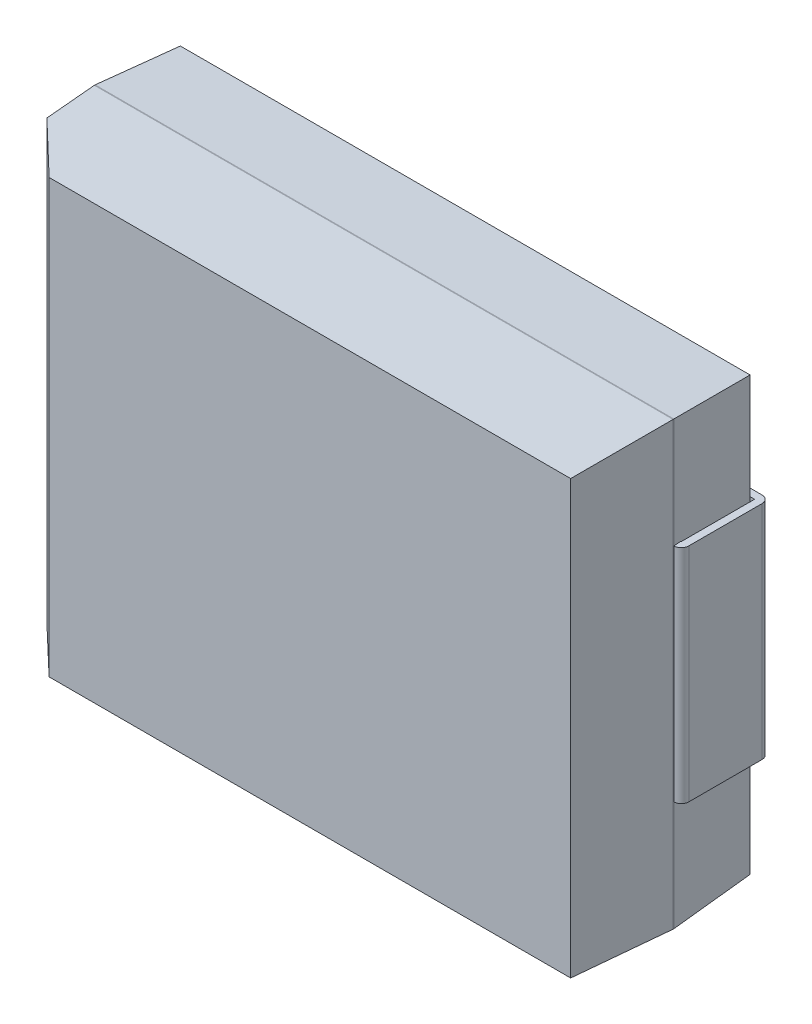
ISO-10303-21;
HEADER;
FILE_DESCRIPTION(('STEP AP214'),'2;1');
FILE_NAME('part.step','',(''),(''),'','','');
FILE_SCHEMA(('AUTOMOTIVE_DESIGN { 1 0 10303 214 1 1 1 1 }'));
ENDSEC;
DATA;
#1=APPLICATION_CONTEXT('core data for automotive mechanical design processes');
#2=APPLICATION_PROTOCOL_DEFINITION('international standard','automotive_design',2000,#1);
#3=PRODUCT_CONTEXT('',#1,'mechanical');
#4=PRODUCT('Part','Part','',(#3));
#5=PRODUCT_RELATED_PRODUCT_CATEGORY('part','',(#4));
#6=PRODUCT_DEFINITION_FORMATION('','',#4);
#7=PRODUCT_DEFINITION_CONTEXT('part definition',#1,'design');
#8=PRODUCT_DEFINITION('design','',#6,#7);
#9=PRODUCT_DEFINITION_SHAPE('','',#8);
#10=(LENGTH_UNIT() NAMED_UNIT(*) SI_UNIT(.MILLI.,.METRE.));
#11=(NAMED_UNIT(*) PLANE_ANGLE_UNIT() SI_UNIT($,.RADIAN.));
#12=(NAMED_UNIT(*) SI_UNIT($,.STERADIAN.) SOLID_ANGLE_UNIT());
#13=UNCERTAINTY_MEASURE_WITH_UNIT(LENGTH_MEASURE(1.E-05),#10,'distance_accuracy_value','');
#14=(GEOMETRIC_REPRESENTATION_CONTEXT(3) GLOBAL_UNCERTAINTY_ASSIGNED_CONTEXT((#13)) GLOBAL_UNIT_ASSIGNED_CONTEXT((#10,
#11,#12)) REPRESENTATION_CONTEXT('',''));
#15=CARTESIAN_POINT('',(0.,0.,0.));
#16=DIRECTION('',(0.,0.,1.));
#17=DIRECTION('',(1.,0.,0.));
#18=AXIS2_PLACEMENT_3D('',#15,#16,#17);
#19=CARTESIAN_POINT('',(-2.93,-1.4825,1.08));
#20=DIRECTION('',(1.,0.,0.));
#21=DIRECTION('',(0.,0.,-1.));
#22=AXIS2_PLACEMENT_3D('',#19,#20,#21);
#23=PLANE('',#22);
#24=DIRECTION('',(0.,0.,-1.));
#25=VECTOR('',#24,1.);
#26=CARTESIAN_POINT('',(-2.93,1.4825,1.08));
#27=LINE('',#26,#25);
#28=CARTESIAN_POINT('',(-2.93,1.4825,1.08));
#29=VERTEX_POINT('',#28);
#30=CARTESIAN_POINT('',(-2.93,1.4825,1.18));
#31=VERTEX_POINT('',#30);
#32=EDGE_CURVE('P0_E100',#29,#31,#27,.F.);
#33=ORIENTED_EDGE('',*,*,#32,.T.);
#34=DIRECTION('',(0.,1.,0.));
#35=VECTOR('',#34,1.);
#36=CARTESIAN_POINT('',(-2.93,-1.4825,1.18));
#37=LINE('',#36,#35);
#38=CARTESIAN_POINT('',(-2.93,-1.4825,1.18));
#39=VERTEX_POINT('',#38);
#40=EDGE_CURVE('P0_E95',#39,#31,#37,.T.);
#41=ORIENTED_EDGE('',*,*,#40,.F.);
#42=DIRECTION('',(0.,0.,-1.));
#43=VECTOR('',#42,1.);
#44=CARTESIAN_POINT('',(-2.93,-1.4825,1.08));
#45=LINE('',#44,#43);
#46=CARTESIAN_POINT('',(-2.93,-1.4825,1.08));
#47=VERTEX_POINT('',#46);
#48=EDGE_CURVE('P0_E134',#39,#47,#45,.T.);
#49=ORIENTED_EDGE('',*,*,#48,.T.);
#50=DIRECTION('',(0.,1.,0.));
#51=VECTOR('',#50,1.);
#52=CARTESIAN_POINT('',(-2.93,-1.4825,1.08));
#53=LINE('',#52,#51);
#54=EDGE_CURVE('P0_E110',#47,#29,#53,.T.);
#55=ORIENTED_EDGE('',*,*,#54,.T.);
#56=EDGE_LOOP('',(#33,#41,#49,#55));
#57=FACE_BOUND('',#56,.T.);
#58=ADVANCED_FACE('P0_F16',(#57),#23,.T.);
#59=CARTESIAN_POINT('',(-3.97,-1.4825,1.18));
#60=DIRECTION('',(0.,0.,1.));
#61=DIRECTION('',(1.,0.,0.));
#62=AXIS2_PLACEMENT_3D('',#59,#60,#61);
#63=PLANE('',#62);
#64=DIRECTION('',(1.,0.,0.));
#65=VECTOR('',#64,1.);
#66=CARTESIAN_POINT('',(-3.97,-1.4825,1.18));
#67=LINE('',#66,#65);
#68=CARTESIAN_POINT('',(-3.87,-1.4825,1.18));
#69=VERTEX_POINT('',#68);
#70=EDGE_CURVE('P0_E99',#69,#39,#67,.T.);
#71=ORIENTED_EDGE('',*,*,#70,.T.);
#72=ORIENTED_EDGE('',*,*,#40,.T.);
#73=DIRECTION('',(1.,0.,0.));
#74=VECTOR('',#73,1.);
#75=CARTESIAN_POINT('',(-3.97,1.4825,1.18));
#76=LINE('',#75,#74);
#77=CARTESIAN_POINT('',(-3.87,1.4825,1.18));
#78=VERTEX_POINT('',#77);
#79=EDGE_CURVE('P0_E90',#31,#78,#76,.F.);
#80=ORIENTED_EDGE('',*,*,#79,.T.);
#81=DIRECTION('',(0.,1.,0.));
#82=VECTOR('',#81,1.);
#83=CARTESIAN_POINT('',(-3.87,-1.4825,1.18));
#84=LINE('',#83,#82);
#85=EDGE_CURVE('P0_E93',#69,#78,#84,.T.);
#86=ORIENTED_EDGE('',*,*,#85,.F.);
#87=EDGE_LOOP('',(#71,#72,#80,#86));
#88=FACE_BOUND('',#87,.T.);
#89=ADVANCED_FACE('P0_F92',(#88),#63,.T.);
#90=CARTESIAN_POINT('',(-3.97,-1.4825,1.08));
#91=DIRECTION('',(0.,0.,1.));
#92=DIRECTION('',(1.,0.,0.));
#93=AXIS2_PLACEMENT_3D('',#90,#91,#92);
#94=PLANE('',#93);
#95=DIRECTION('',(1.,0.,0.));
#96=VECTOR('',#95,1.);
#97=CARTESIAN_POINT('',(-3.97,-1.4825,1.08));
#98=LINE('',#97,#96);
#99=CARTESIAN_POINT('',(-3.87,-1.4825,1.08));
#100=VERTEX_POINT('',#99);
#101=EDGE_CURVE('P0_E142',#100,#47,#98,.T.);
#102=ORIENTED_EDGE('',*,*,#101,.F.);
#103=DIRECTION('',(0.,1.,0.));
#104=VECTOR('',#103,1.);
#105=CARTESIAN_POINT('',(-3.87,-1.4825,1.08));
#106=LINE('',#105,#104);
#107=CARTESIAN_POINT('',(-3.87,1.4825,1.08));
#108=VERTEX_POINT('',#107);
#109=EDGE_CURVE('P0_E154',#108,#100,#106,.F.);
#110=ORIENTED_EDGE('',*,*,#109,.F.);
#111=DIRECTION('',(1.,0.,0.));
#112=VECTOR('',#111,1.);
#113=CARTESIAN_POINT('',(-3.97,1.4825,1.08));
#114=LINE('',#113,#112);
#115=EDGE_CURVE('P0_E130',#29,#108,#114,.F.);
#116=ORIENTED_EDGE('',*,*,#115,.F.);
#117=ORIENTED_EDGE('',*,*,#54,.F.);
#118=EDGE_LOOP('',(#102,#110,#116,#117));
#119=FACE_BOUND('',#118,.T.);
#120=ADVANCED_FACE('P0_F308',(#119),#94,.F.);
#121=CARTESIAN_POINT('',(-3.87,-1.4825,1.08));
#122=DIRECTION('',(0.,1.,0.));
#123=DIRECTION('',(0.,0.,1.));
#124=AXIS2_PLACEMENT_3D('',#121,#122,#123);
#125=CYLINDRICAL_SURFACE('',#124,0.1);
#126=DIRECTION('',(0.,1.,0.));
#127=VECTOR('',#126,1.);
#128=CARTESIAN_POINT('',(-3.97,-1.4825,1.08));
#129=LINE('',#128,#127);
#130=CARTESIAN_POINT('',(-3.97,1.4825,1.08));
#131=VERTEX_POINT('',#130);
#132=CARTESIAN_POINT('',(-3.97,-1.4825,1.08));
#133=VERTEX_POINT('',#132);
#134=EDGE_CURVE('P0_E167',#131,#133,#129,.F.);
#135=ORIENTED_EDGE('',*,*,#134,.T.);
#136=CARTESIAN_POINT('',(-3.87,-1.4825,1.08));
#137=DIRECTION('',(0.,1.,0.));
#138=DIRECTION('',(0.,0.,1.));
#139=AXIS2_PLACEMENT_3D('',#136,#137,#138);
#140=CIRCLE('',#139,0.1);
#141=EDGE_CURVE('P0_E109',#133,#69,#140,.T.);
#142=ORIENTED_EDGE('',*,*,#141,.T.);
#143=ORIENTED_EDGE('',*,*,#85,.T.);
#144=CARTESIAN_POINT('',(-3.87,1.4825,1.08));
#145=DIRECTION('',(0.,1.,0.));
#146=DIRECTION('',(0.,0.,1.));
#147=AXIS2_PLACEMENT_3D('',#144,#145,#146);
#148=CIRCLE('',#147,0.1);
#149=EDGE_CURVE('P0_E19',#78,#131,#148,.F.);
#150=ORIENTED_EDGE('',*,*,#149,.T.);
#151=EDGE_LOOP('',(#135,#142,#143,#150));
#152=FACE_BOUND('',#151,.T.);
#153=ADVANCED_FACE('P0_F106',(#152),#125,.T.);
#154=CARTESIAN_POINT('',(-3.87,-1.4825,0.));
#155=DIRECTION('',(1.,0.,0.));
#156=DIRECTION('',(0.,0.,-1.));
#157=AXIS2_PLACEMENT_3D('',#154,#155,#156);
#158=PLANE('',#157);
#159=DIRECTION('',(0.,0.,-1.));
#160=VECTOR('',#159,1.);
#161=CARTESIAN_POINT('',(-3.87,1.4825,0.));
#162=LINE('',#161,#160);
#163=CARTESIAN_POINT('',(-3.87,1.4825,0.1));
#164=VERTEX_POINT('',#163);
#165=EDGE_CURVE('P0_E118',#164,#108,#162,.F.);
#166=ORIENTED_EDGE('',*,*,#165,.T.);
#167=ORIENTED_EDGE('',*,*,#109,.T.);
#168=DIRECTION('',(0.,0.,-1.));
#169=VECTOR('',#168,1.);
#170=CARTESIAN_POINT('',(-3.87,-1.4825,0.));
#171=LINE('',#170,#169);
#172=CARTESIAN_POINT('',(-3.87,-1.4825,0.1));
#173=VERTEX_POINT('',#172);
#174=EDGE_CURVE('P0_E117',#100,#173,#171,.T.);
#175=ORIENTED_EDGE('',*,*,#174,.T.);
#176=DIRECTION('',(0.,1.,0.));
#177=VECTOR('',#176,1.);
#178=CARTESIAN_POINT('',(-3.87,-1.4825,0.1));
#179=LINE('',#178,#177);
#180=EDGE_CURVE('P0_E169',#164,#173,#179,.F.);
#181=ORIENTED_EDGE('',*,*,#180,.F.);
#182=EDGE_LOOP('',(#166,#167,#175,#181));
#183=FACE_BOUND('',#182,.T.);
#184=ADVANCED_FACE('P0_F229',(#183),#158,.T.);
#185=CARTESIAN_POINT('',(-3.97,-1.4825,0.));
#186=DIRECTION('',(1.,0.,0.));
#187=DIRECTION('',(0.,0.,-1.));
#188=AXIS2_PLACEMENT_3D('',#185,#186,#187);
#189=PLANE('',#188);
#190=DIRECTION('',(0.,0.,1.));
#191=VECTOR('',#190,1.);
#192=CARTESIAN_POINT('',(-3.97,1.4825,0.573435582822));
#193=LINE('',#192,#191);
#194=CARTESIAN_POINT('',(-3.97,1.4825,0.1));
#195=VERTEX_POINT('',#194);
#196=EDGE_CURVE('P0_E116',#195,#131,#193,.T.);
#197=ORIENTED_EDGE('',*,*,#196,.F.);
#198=DIRECTION('',(0.,1.,0.));
#199=VECTOR('',#198,1.);
#200=CARTESIAN_POINT('',(-3.97,-1.4825,0.1));
#201=LINE('',#200,#199);
#202=CARTESIAN_POINT('',(-3.97,-1.4825,0.1));
#203=VERTEX_POINT('',#202);
#204=EDGE_CURVE('P0_E124',#203,#195,#201,.T.);
#205=ORIENTED_EDGE('',*,*,#204,.F.);
#206=DIRECTION('',(0.,0.,-1.));
#207=VECTOR('',#206,1.);
#208=CARTESIAN_POINT('',(-3.97,-1.4825,0.));
#209=LINE('',#208,#207);
#210=EDGE_CURVE('P0_E157',#133,#203,#209,.T.);
#211=ORIENTED_EDGE('',*,*,#210,.F.);
#212=ORIENTED_EDGE('',*,*,#134,.F.);
#213=EDGE_LOOP('',(#197,#205,#211,#212));
#214=FACE_BOUND('',#213,.T.);
#215=ADVANCED_FACE('P0_F226',(#214),#189,.F.);
#216=CARTESIAN_POINT('',(-3.97,-1.4825,0.1));
#217=DIRECTION('',(0.,0.,1.));
#218=DIRECTION('',(1.,0.,0.));
#219=AXIS2_PLACEMENT_3D('',#216,#217,#218);
#220=PLANE('',#219);
#221=DIRECTION('',(1.,0.,0.));
#222=VECTOR('',#221,1.);
#223=CARTESIAN_POINT('',(-3.557852760736,-1.4825,0.1));
#224=LINE('',#223,#222);
#225=CARTESIAN_POINT('',(-2.83,-1.4825,0.1));
#226=VERTEX_POINT('',#225);
#227=EDGE_CURVE('P0_E126',#226,#173,#224,.F.);
#228=ORIENTED_EDGE('',*,*,#227,.F.);
#229=DIRECTION('',(0.,1.,0.));
#230=VECTOR('',#229,1.);
#231=CARTESIAN_POINT('',(-2.83,-1.4825,0.1));
#232=LINE('',#231,#230);
#233=CARTESIAN_POINT('',(-2.83,1.4825,0.1));
#234=VERTEX_POINT('',#233);
#235=EDGE_CURVE('P0_E183',#234,#226,#232,.F.);
#236=ORIENTED_EDGE('',*,*,#235,.F.);
#237=DIRECTION('',(-1.,0.,0.));
#238=VECTOR('',#237,1.);
#239=CARTESIAN_POINT('',(-3.557852760736,1.4825,0.1));
#240=LINE('',#239,#238);
#241=EDGE_CURVE('P0_E172',#164,#234,#240,.F.);
#242=ORIENTED_EDGE('',*,*,#241,.F.);
#243=ORIENTED_EDGE('',*,*,#180,.T.);
#244=EDGE_LOOP('',(#228,#236,#242,#243));
#245=FACE_BOUND('',#244,.T.);
#246=ADVANCED_FACE('P0_F228',(#245),#220,.T.);
#247=CARTESIAN_POINT('',(-3.557852760736,1.4825,0.573435582822));
#248=DIRECTION('',(0.,1.,0.));
#249=DIRECTION('',(-1.,0.,0.));
#250=AXIS2_PLACEMENT_3D('',#247,#248,#249);
#251=PLANE('',#250);
#252=ORIENTED_EDGE('',*,*,#241,.T.);
#253=DIRECTION('',(0.,0.,-1.));
#254=VECTOR('',#253,1.);
#255=CARTESIAN_POINT('',(-2.83,1.4825,0.));
#256=LINE('',#255,#254);
#257=CARTESIAN_POINT('',(-2.83,1.4825,0.));
#258=VERTEX_POINT('',#257);
#259=EDGE_CURVE('P0_E186',#258,#234,#256,.F.);
#260=ORIENTED_EDGE('',*,*,#259,.F.);
#261=DIRECTION('',(1.,0.,0.));
#262=VECTOR('',#261,1.);
#263=CARTESIAN_POINT('',(-3.97,1.4825,0.));
#264=LINE('',#263,#262);
#265=CARTESIAN_POINT('',(-3.87,1.4825,0.));
#266=VERTEX_POINT('',#265);
#267=EDGE_CURVE('P0_E185',#258,#266,#264,.F.);
#268=ORIENTED_EDGE('',*,*,#267,.T.);
#269=CARTESIAN_POINT('',(-3.87,1.4825,0.1));
#270=DIRECTION('',(0.,1.,0.));
#271=DIRECTION('',(0.,0.,1.));
#272=AXIS2_PLACEMENT_3D('',#269,#270,#271);
#273=CIRCLE('',#272,0.1);
#274=EDGE_CURVE('P0_E121',#195,#266,#273,.F.);
#275=ORIENTED_EDGE('',*,*,#274,.F.);
#276=ORIENTED_EDGE('',*,*,#196,.T.);
#277=ORIENTED_EDGE('',*,*,#149,.F.);
#278=ORIENTED_EDGE('',*,*,#79,.F.);
#279=ORIENTED_EDGE('',*,*,#32,.F.);
#280=ORIENTED_EDGE('',*,*,#115,.T.);
#281=ORIENTED_EDGE('',*,*,#165,.F.);
#282=EDGE_LOOP('',(#252,#260,#268,#275,#276,#277,#278,#279,#280,#281));
#283=FACE_BOUND('',#282,.T.);
#284=ADVANCED_FACE('P0_F113',(#283),#251,.T.);
#285=CARTESIAN_POINT('',(-3.87,-1.4825,0.1));
#286=DIRECTION('',(0.,1.,0.));
#287=DIRECTION('',(0.,0.,1.));
#288=AXIS2_PLACEMENT_3D('',#285,#286,#287);
#289=CYLINDRICAL_SURFACE('',#288,0.1);
#290=DIRECTION('',(0.,1.,0.));
#291=VECTOR('',#290,1.);
#292=CARTESIAN_POINT('',(-3.87,-1.4825,0.));
#293=LINE('',#292,#291);
#294=CARTESIAN_POINT('',(-3.87,-1.4825,0.));
#295=VERTEX_POINT('',#294);
#296=EDGE_CURVE('P0_E199',#266,#295,#293,.F.);
#297=ORIENTED_EDGE('',*,*,#296,.T.);
#298=CARTESIAN_POINT('',(-3.87,-1.4825,0.1));
#299=DIRECTION('',(0.,1.,0.));
#300=DIRECTION('',(0.,0.,1.));
#301=AXIS2_PLACEMENT_3D('',#298,#299,#300);
#302=CIRCLE('',#301,0.1);
#303=EDGE_CURVE('P0_E123',#203,#295,#302,.F.);
#304=ORIENTED_EDGE('',*,*,#303,.F.);
#305=ORIENTED_EDGE('',*,*,#204,.T.);
#306=ORIENTED_EDGE('',*,*,#274,.T.);
#307=EDGE_LOOP('',(#297,#304,#305,#306));
#308=FACE_BOUND('',#307,.T.);
#309=ADVANCED_FACE('P0_F213',(#308),#289,.T.);
#310=CARTESIAN_POINT('',(-3.557852760736,-1.4825,0.573435582822));
#311=DIRECTION('',(0.,-1.,0.));
#312=DIRECTION('',(1.,0.,0.));
#313=AXIS2_PLACEMENT_3D('',#310,#311,#312);
#314=PLANE('',#313);
#315=ORIENTED_EDGE('',*,*,#101,.T.);
#316=ORIENTED_EDGE('',*,*,#48,.F.);
#317=ORIENTED_EDGE('',*,*,#70,.F.);
#318=ORIENTED_EDGE('',*,*,#141,.F.);
#319=ORIENTED_EDGE('',*,*,#210,.T.);
#320=ORIENTED_EDGE('',*,*,#303,.T.);
#321=DIRECTION('',(1.,0.,0.));
#322=VECTOR('',#321,1.);
#323=CARTESIAN_POINT('',(-3.97,-1.4825,0.));
#324=LINE('',#323,#322);
#325=CARTESIAN_POINT('',(-2.83,-1.4825,0.));
#326=VERTEX_POINT('',#325);
#327=EDGE_CURVE('P0_E25',#295,#326,#324,.T.);
#328=ORIENTED_EDGE('',*,*,#327,.T.);
#329=DIRECTION('',(0.,0.,-1.));
#330=VECTOR('',#329,1.);
#331=CARTESIAN_POINT('',(-2.83,-1.4825,0.));
#332=LINE('',#331,#330);
#333=EDGE_CURVE('P0_E33',#226,#326,#332,.T.);
#334=ORIENTED_EDGE('',*,*,#333,.F.);
#335=ORIENTED_EDGE('',*,*,#227,.T.);
#336=ORIENTED_EDGE('',*,*,#174,.F.);
#337=EDGE_LOOP('',(#315,#316,#317,#318,#319,#320,#328,#334,#335,#336));
#338=FACE_BOUND('',#337,.T.);
#339=ADVANCED_FACE('P0_F223',(#338),#314,.T.);
#340=CARTESIAN_POINT('',(-2.83,-1.4825,0.));
#341=DIRECTION('',(1.,0.,0.));
#342=DIRECTION('',(0.,0.,-1.));
#343=AXIS2_PLACEMENT_3D('',#340,#341,#342);
#344=PLANE('',#343);
#345=ORIENTED_EDGE('',*,*,#259,.T.);
#346=ORIENTED_EDGE('',*,*,#235,.T.);
#347=ORIENTED_EDGE('',*,*,#333,.T.);
#348=DIRECTION('',(0.,1.,0.));
#349=VECTOR('',#348,1.);
#350=CARTESIAN_POINT('',(-2.83,-1.4825,0.));
#351=LINE('',#350,#349);
#352=EDGE_CURVE('P0_E11',#326,#258,#351,.T.);
#353=ORIENTED_EDGE('',*,*,#352,.T.);
#354=EDGE_LOOP('',(#345,#346,#347,#353));
#355=FACE_BOUND('',#354,.T.);
#356=ADVANCED_FACE('P0_F221',(#355),#344,.T.);
#357=CARTESIAN_POINT('',(-3.97,-1.4825,0.));
#358=DIRECTION('',(0.,0.,1.));
#359=DIRECTION('',(1.,0.,0.));
#360=AXIS2_PLACEMENT_3D('',#357,#358,#359);
#361=PLANE('',#360);
#362=ORIENTED_EDGE('',*,*,#327,.F.);
#363=ORIENTED_EDGE('',*,*,#296,.F.);
#364=ORIENTED_EDGE('',*,*,#267,.F.);
#365=ORIENTED_EDGE('',*,*,#352,.F.);
#366=EDGE_LOOP('',(#362,#363,#364,#365));
#367=FACE_BOUND('',#366,.T.);
#368=ADVANCED_FACE('P0_F217',(#367),#361,.F.);
#369=CLOSED_SHELL('',(#58,#89,#120,#153,#184,#215,#246,#284,#309,#339,#356,#368));
#370=MANIFOLD_SOLID_BREP('P0_B1',#369);
#371=CARTESIAN_POINT('',(2.83,-1.4825,1.08));
#372=DIRECTION('',(1.,0.,0.));
#373=DIRECTION('',(0.,0.,-1.));
#374=AXIS2_PLACEMENT_3D('',#371,#372,#373);
#375=PLANE('',#374);
#376=DIRECTION('',(0.,0.,-1.));
#377=VECTOR('',#376,1.);
#378=CARTESIAN_POINT('',(2.83,1.4825,1.08));
#379=LINE('',#378,#377);
#380=CARTESIAN_POINT('',(2.83,1.4825,1.08));
#381=VERTEX_POINT('',#380);
#382=CARTESIAN_POINT('',(2.83,1.4825,1.18));
#383=VERTEX_POINT('',#382);
#384=EDGE_CURVE('P1_E116',#381,#383,#379,.F.);
#385=ORIENTED_EDGE('',*,*,#384,.F.);
#386=DIRECTION('',(0.,1.,0.));
#387=VECTOR('',#386,1.);
#388=CARTESIAN_POINT('',(2.83,-1.4825,1.08));
#389=LINE('',#388,#387);
#390=CARTESIAN_POINT('',(2.83,-1.4825,1.08));
#391=VERTEX_POINT('',#390);
#392=EDGE_CURVE('P1_E114',#381,#391,#389,.F.);
#393=ORIENTED_EDGE('',*,*,#392,.T.);
#394=DIRECTION('',(0.,0.,-1.));
#395=VECTOR('',#394,1.);
#396=CARTESIAN_POINT('',(2.83,-1.4825,1.08));
#397=LINE('',#396,#395);
#398=CARTESIAN_POINT('',(2.83,-1.4825,1.18));
#399=VERTEX_POINT('',#398);
#400=EDGE_CURVE('P1_E95',#399,#391,#397,.T.);
#401=ORIENTED_EDGE('',*,*,#400,.F.);
#402=DIRECTION('',(0.,1.,0.));
#403=VECTOR('',#402,1.);
#404=CARTESIAN_POINT('',(2.83,0.,1.18));
#405=LINE('',#404,#403);
#406=EDGE_CURVE('P1_E111',#383,#399,#405,.F.);
#407=ORIENTED_EDGE('',*,*,#406,.F.);
#408=EDGE_LOOP('',(#385,#393,#401,#407));
#409=FACE_BOUND('',#408,.T.);
#410=ADVANCED_FACE('P1_F16',(#409),#375,.F.);
#411=CARTESIAN_POINT('',(2.83,-1.4825,1.08));
#412=DIRECTION('',(0.,0.,1.));
#413=DIRECTION('',(1.,0.,0.));
#414=AXIS2_PLACEMENT_3D('',#411,#412,#413);
#415=PLANE('',#414);
#416=DIRECTION('',(0.,1.,0.));
#417=VECTOR('',#416,1.);
#418=CARTESIAN_POINT('',(3.87,-1.4825,1.08));
#419=LINE('',#418,#417);
#420=CARTESIAN_POINT('',(3.87,1.4825,1.08));
#421=VERTEX_POINT('',#420);
#422=CARTESIAN_POINT('',(3.87,-1.4825,1.08));
#423=VERTEX_POINT('',#422);
#424=EDGE_CURVE('P1_E152',#421,#423,#419,.F.);
#425=ORIENTED_EDGE('',*,*,#424,.T.);
#426=DIRECTION('',(1.,0.,0.));
#427=VECTOR('',#426,1.);
#428=CARTESIAN_POINT('',(2.83,-1.4825,1.08));
#429=LINE('',#428,#427);
#430=EDGE_CURVE('P1_E136',#391,#423,#429,.T.);
#431=ORIENTED_EDGE('',*,*,#430,.F.);
#432=ORIENTED_EDGE('',*,*,#392,.F.);
#433=DIRECTION('',(1.,0.,0.));
#434=VECTOR('',#433,1.);
#435=CARTESIAN_POINT('',(2.83,1.4825,1.08));
#436=LINE('',#435,#434);
#437=EDGE_CURVE('P1_E107',#421,#381,#436,.F.);
#438=ORIENTED_EDGE('',*,*,#437,.F.);
#439=EDGE_LOOP('',(#425,#431,#432,#438));
#440=FACE_BOUND('',#439,.T.);
#441=ADVANCED_FACE('P1_F173',(#440),#415,.F.);
#442=CARTESIAN_POINT('',(3.4,0.,1.18));
#443=DIRECTION('',(0.,0.,1.));
#444=DIRECTION('',(1.,0.,0.));
#445=AXIS2_PLACEMENT_3D('',#442,#443,#444);
#446=PLANE('',#445);
#447=DIRECTION('',(1.,0.,0.));
#448=VECTOR('',#447,1.);
#449=CARTESIAN_POINT('',(3.4,1.4825,1.18));
#450=LINE('',#449,#448);
#451=CARTESIAN_POINT('',(3.87,1.4825,1.18));
#452=VERTEX_POINT('',#451);
#453=EDGE_CURVE('P1_E106',#452,#383,#450,.F.);
#454=ORIENTED_EDGE('',*,*,#453,.T.);
#455=ORIENTED_EDGE('',*,*,#406,.T.);
#456=DIRECTION('',(1.,0.,0.));
#457=VECTOR('',#456,1.);
#458=CARTESIAN_POINT('',(3.4,-1.4825,1.18));
#459=LINE('',#458,#457);
#460=CARTESIAN_POINT('',(3.87,-1.4825,1.18));
#461=VERTEX_POINT('',#460);
#462=EDGE_CURVE('P1_E98',#399,#461,#459,.T.);
#463=ORIENTED_EDGE('',*,*,#462,.T.);
#464=DIRECTION('',(0.,1.,0.));
#465=VECTOR('',#464,1.);
#466=CARTESIAN_POINT('',(3.87,-1.4825,1.18));
#467=LINE('',#466,#465);
#468=EDGE_CURVE('P1_E145',#452,#461,#467,.F.);
#469=ORIENTED_EDGE('',*,*,#468,.F.);
#470=EDGE_LOOP('',(#454,#455,#463,#469));
#471=FACE_BOUND('',#470,.T.);
#472=ADVANCED_FACE('P1_F118',(#471),#446,.T.);
#473=CARTESIAN_POINT('',(3.87,-1.4825,0.));
#474=DIRECTION('',(1.,0.,0.));
#475=DIRECTION('',(0.,0.,-1.));
#476=AXIS2_PLACEMENT_3D('',#473,#474,#475);
#477=PLANE('',#476);
#478=DIRECTION('',(0.,0.,-1.));
#479=VECTOR('',#478,1.);
#480=CARTESIAN_POINT('',(3.87,1.4825,0.));
#481=LINE('',#480,#479);
#482=CARTESIAN_POINT('',(3.87,1.4825,0.1));
#483=VERTEX_POINT('',#482);
#484=EDGE_CURVE('P1_E121',#483,#421,#481,.F.);
#485=ORIENTED_EDGE('',*,*,#484,.F.);
#486=DIRECTION('',(0.,1.,0.));
#487=VECTOR('',#486,1.);
#488=CARTESIAN_POINT('',(3.87,-1.4825,0.1));
#489=LINE('',#488,#487);
#490=CARTESIAN_POINT('',(3.87,-1.4825,0.1));
#491=VERTEX_POINT('',#490);
#492=EDGE_CURVE('P1_E144',#491,#483,#489,.T.);
#493=ORIENTED_EDGE('',*,*,#492,.F.);
#494=DIRECTION('',(0.,0.,-1.));
#495=VECTOR('',#494,1.);
#496=CARTESIAN_POINT('',(3.87,-1.4825,0.));
#497=LINE('',#496,#495);
#498=EDGE_CURVE('P1_E119',#423,#491,#497,.T.);
#499=ORIENTED_EDGE('',*,*,#498,.F.);
#500=ORIENTED_EDGE('',*,*,#424,.F.);
#501=EDGE_LOOP('',(#485,#493,#499,#500));
#502=FACE_BOUND('',#501,.T.);
#503=ADVANCED_FACE('P1_F175',(#502),#477,.F.);
#504=CARTESIAN_POINT('',(3.87,-1.4825,1.08));
#505=DIRECTION('',(0.,1.,0.));
#506=DIRECTION('',(0.,0.,1.));
#507=AXIS2_PLACEMENT_3D('',#504,#505,#506);
#508=CYLINDRICAL_SURFACE('',#507,0.1);
#509=ORIENTED_EDGE('',*,*,#468,.T.);
#510=CARTESIAN_POINT('',(3.87,-1.4825,1.08));
#511=DIRECTION('',(0.,1.,0.));
#512=DIRECTION('',(0.,0.,1.));
#513=AXIS2_PLACEMENT_3D('',#510,#511,#512);
#514=CIRCLE('',#513,0.1);
#515=CARTESIAN_POINT('',(3.97,-1.4825,1.08));
#516=VERTEX_POINT('',#515);
#517=EDGE_CURVE('P1_E101',#461,#516,#514,.T.);
#518=ORIENTED_EDGE('',*,*,#517,.T.);
#519=DIRECTION('',(0.,1.,0.));
#520=VECTOR('',#519,1.);
#521=CARTESIAN_POINT('',(3.97,-1.4825,1.08));
#522=LINE('',#521,#520);
#523=CARTESIAN_POINT('',(3.97,1.4825,1.08));
#524=VERTEX_POINT('',#523);
#525=EDGE_CURVE('P1_E186',#524,#516,#522,.F.);
#526=ORIENTED_EDGE('',*,*,#525,.F.);
#527=CARTESIAN_POINT('',(3.87,1.4825,1.08));
#528=DIRECTION('',(0.,1.,0.));
#529=DIRECTION('',(0.,0.,1.));
#530=AXIS2_PLACEMENT_3D('',#527,#528,#529);
#531=CIRCLE('',#530,0.1);
#532=EDGE_CURVE('P1_E19',#524,#452,#531,.F.);
#533=ORIENTED_EDGE('',*,*,#532,.T.);
#534=EDGE_LOOP('',(#509,#518,#526,#533));
#535=FACE_BOUND('',#534,.T.);
#536=ADVANCED_FACE('P1_F291',(#535),#508,.T.);
#537=CARTESIAN_POINT('',(2.73,-1.4825,0.1));
#538=DIRECTION('',(0.,0.,1.));
#539=DIRECTION('',(1.,0.,0.));
#540=AXIS2_PLACEMENT_3D('',#537,#538,#539);
#541=PLANE('',#540);
#542=ORIENTED_EDGE('',*,*,#492,.T.);
#543=DIRECTION('',(1.,0.,0.));
#544=VECTOR('',#543,1.);
#545=CARTESIAN_POINT('',(2.73,1.4825,0.1));
#546=LINE('',#545,#544);
#547=CARTESIAN_POINT('',(2.73,1.4825,0.1));
#548=VERTEX_POINT('',#547);
#549=EDGE_CURVE('P1_E149',#483,#548,#546,.F.);
#550=ORIENTED_EDGE('',*,*,#549,.T.);
#551=DIRECTION('',(0.,1.,0.));
#552=VECTOR('',#551,1.);
#553=CARTESIAN_POINT('',(2.73,-1.4825,0.1));
#554=LINE('',#553,#552);
#555=CARTESIAN_POINT('',(2.73,-1.4825,0.1));
#556=VERTEX_POINT('',#555);
#557=EDGE_CURVE('P1_E180',#548,#556,#554,.F.);
#558=ORIENTED_EDGE('',*,*,#557,.T.);
#559=DIRECTION('',(1.,0.,0.));
#560=VECTOR('',#559,1.);
#561=CARTESIAN_POINT('',(3.51289017341,-1.4825,0.1));
#562=LINE('',#561,#560);
#563=EDGE_CURVE('P1_E73',#491,#556,#562,.F.);
#564=ORIENTED_EDGE('',*,*,#563,.F.);
#565=EDGE_LOOP('',(#542,#550,#558,#564));
#566=FACE_BOUND('',#565,.T.);
#567=ADVANCED_FACE('P1_F178',(#566),#541,.T.);
#568=CARTESIAN_POINT('',(3.97,-1.4825,0.));
#569=DIRECTION('',(1.,0.,0.));
#570=DIRECTION('',(0.,0.,-1.));
#571=AXIS2_PLACEMENT_3D('',#568,#569,#570);
#572=PLANE('',#571);
#573=DIRECTION('',(0.,0.,1.));
#574=VECTOR('',#573,1.);
#575=CARTESIAN_POINT('',(3.97,1.4825,0.574393063584));
#576=LINE('',#575,#574);
#577=CARTESIAN_POINT('',(3.97,1.4825,0.1));
#578=VERTEX_POINT('',#577);
#579=EDGE_CURVE('P1_E204',#524,#578,#576,.F.);
#580=ORIENTED_EDGE('',*,*,#579,.F.);
#581=ORIENTED_EDGE('',*,*,#525,.T.);
#582=DIRECTION('',(0.,0.,1.));
#583=VECTOR('',#582,1.);
#584=CARTESIAN_POINT('',(3.97,-1.4825,0.574393063584));
#585=LINE('',#584,#583);
#586=CARTESIAN_POINT('',(3.97,-1.4825,0.1));
#587=VERTEX_POINT('',#586);
#588=EDGE_CURVE('P1_E183',#587,#516,#585,.T.);
#589=ORIENTED_EDGE('',*,*,#588,.F.);
#590=DIRECTION('',(0.,1.,0.));
#591=VECTOR('',#590,1.);
#592=CARTESIAN_POINT('',(3.97,-1.4825,0.1));
#593=LINE('',#592,#591);
#594=EDGE_CURVE('P1_E140',#578,#587,#593,.F.);
#595=ORIENTED_EDGE('',*,*,#594,.F.);
#596=EDGE_LOOP('',(#580,#581,#589,#595));
#597=FACE_BOUND('',#596,.T.);
#598=ADVANCED_FACE('P1_F229',(#597),#572,.T.);
#599=CARTESIAN_POINT('',(3.51289017341,-1.4825,0.574393063584));
#600=DIRECTION('',(0.,-1.,0.));
#601=DIRECTION('',(1.,0.,0.));
#602=AXIS2_PLACEMENT_3D('',#599,#600,#601);
#603=PLANE('',#602);
#604=ORIENTED_EDGE('',*,*,#563,.T.);
#605=DIRECTION('',(0.,0.,-1.));
#606=VECTOR('',#605,1.);
#607=CARTESIAN_POINT('',(2.73,-1.4825,0.));
#608=LINE('',#607,#606);
#609=CARTESIAN_POINT('',(2.73,-1.4825,0.));
#610=VERTEX_POINT('',#609);
#611=EDGE_CURVE('P1_E182',#556,#610,#608,.T.);
#612=ORIENTED_EDGE('',*,*,#611,.T.);
#613=DIRECTION('',(-1.,0.,0.));
#614=VECTOR('',#613,1.);
#615=CARTESIAN_POINT('',(3.35,-1.4825,0.));
#616=LINE('',#615,#614);
#617=CARTESIAN_POINT('',(3.87,-1.4825,0.));
#618=VERTEX_POINT('',#617);
#619=EDGE_CURVE('P1_E206',#618,#610,#616,.T.);
#620=ORIENTED_EDGE('',*,*,#619,.F.);
#621=CARTESIAN_POINT('',(3.87,-1.4825,0.1));
#622=DIRECTION('',(0.,1.,0.));
#623=DIRECTION('',(0.,0.,1.));
#624=AXIS2_PLACEMENT_3D('',#621,#622,#623);
#625=CIRCLE('',#624,0.1);
#626=EDGE_CURVE('P1_E141',#587,#618,#625,.T.);
#627=ORIENTED_EDGE('',*,*,#626,.F.);
#628=ORIENTED_EDGE('',*,*,#588,.T.);
#629=ORIENTED_EDGE('',*,*,#517,.F.);
#630=ORIENTED_EDGE('',*,*,#462,.F.);
#631=ORIENTED_EDGE('',*,*,#400,.T.);
#632=ORIENTED_EDGE('',*,*,#430,.T.);
#633=ORIENTED_EDGE('',*,*,#498,.T.);
#634=EDGE_LOOP('',(#604,#612,#620,#627,#628,#629,#630,#631,#632,#633));
#635=FACE_BOUND('',#634,.T.);
#636=ADVANCED_FACE('P1_F99',(#635),#603,.T.);
#637=CARTESIAN_POINT('',(2.73,-1.4825,0.));
#638=DIRECTION('',(1.,0.,0.));
#639=DIRECTION('',(0.,0.,-1.));
#640=AXIS2_PLACEMENT_3D('',#637,#638,#639);
#641=PLANE('',#640);
#642=DIRECTION('',(0.,0.,1.));
#643=VECTOR('',#642,1.);
#644=CARTESIAN_POINT('',(2.73,1.4825,0.574393063584));
#645=LINE('',#644,#643);
#646=CARTESIAN_POINT('',(2.73,1.4825,0.));
#647=VERTEX_POINT('',#646);
#648=EDGE_CURVE('P1_E143',#647,#548,#645,.T.);
#649=ORIENTED_EDGE('',*,*,#648,.F.);
#650=DIRECTION('',(0.,1.,0.));
#651=VECTOR('',#650,1.);
#652=CARTESIAN_POINT('',(2.73,0.,0.));
#653=LINE('',#652,#651);
#654=EDGE_CURVE('P1_E212',#610,#647,#653,.T.);
#655=ORIENTED_EDGE('',*,*,#654,.F.);
#656=ORIENTED_EDGE('',*,*,#611,.F.);
#657=ORIENTED_EDGE('',*,*,#557,.F.);
#658=EDGE_LOOP('',(#649,#655,#656,#657));
#659=FACE_BOUND('',#658,.T.);
#660=ADVANCED_FACE('P1_F237',(#659),#641,.F.);
#661=CARTESIAN_POINT('',(3.51289017341,1.4825,0.574393063584));
#662=DIRECTION('',(0.,1.,0.));
#663=DIRECTION('',(-1.,0.,0.));
#664=AXIS2_PLACEMENT_3D('',#661,#662,#663);
#665=PLANE('',#664);
#666=ORIENTED_EDGE('',*,*,#437,.T.);
#667=ORIENTED_EDGE('',*,*,#384,.T.);
#668=ORIENTED_EDGE('',*,*,#453,.F.);
#669=ORIENTED_EDGE('',*,*,#532,.F.);
#670=ORIENTED_EDGE('',*,*,#579,.T.);
#671=CARTESIAN_POINT('',(3.87,1.4825,0.1));
#672=DIRECTION('',(0.,1.,0.));
#673=DIRECTION('',(0.,0.,1.));
#674=AXIS2_PLACEMENT_3D('',#671,#672,#673);
#675=CIRCLE('',#674,0.1);
#676=CARTESIAN_POINT('',(3.87,1.4825,0.));
#677=VERTEX_POINT('',#676);
#678=EDGE_CURVE('P1_E34',#677,#578,#675,.F.);
#679=ORIENTED_EDGE('',*,*,#678,.F.);
#680=DIRECTION('',(-1.,0.,0.));
#681=VECTOR('',#680,1.);
#682=CARTESIAN_POINT('',(3.35,1.4825,0.));
#683=LINE('',#682,#681);
#684=EDGE_CURVE('P1_E25',#647,#677,#683,.F.);
#685=ORIENTED_EDGE('',*,*,#684,.F.);
#686=ORIENTED_EDGE('',*,*,#648,.T.);
#687=ORIENTED_EDGE('',*,*,#549,.F.);
#688=ORIENTED_EDGE('',*,*,#484,.T.);
#689=EDGE_LOOP('',(#666,#667,#668,#669,#670,#679,#685,#686,#687,#688));
#690=FACE_BOUND('',#689,.T.);
#691=ADVANCED_FACE('P1_F197',(#690),#665,.T.);
#692=CARTESIAN_POINT('',(3.87,-1.4825,0.1));
#693=DIRECTION('',(0.,1.,0.));
#694=DIRECTION('',(0.,0.,1.));
#695=AXIS2_PLACEMENT_3D('',#692,#693,#694);
#696=CYLINDRICAL_SURFACE('',#695,0.1);
#697=ORIENTED_EDGE('',*,*,#678,.T.);
#698=ORIENTED_EDGE('',*,*,#594,.T.);
#699=ORIENTED_EDGE('',*,*,#626,.T.);
#700=DIRECTION('',(0.,1.,0.));
#701=VECTOR('',#700,1.);
#702=CARTESIAN_POINT('',(3.87,0.,0.));
#703=LINE('',#702,#701);
#704=EDGE_CURVE('P1_E11',#677,#618,#703,.F.);
#705=ORIENTED_EDGE('',*,*,#704,.F.);
#706=EDGE_LOOP('',(#697,#698,#699,#705));
#707=FACE_BOUND('',#706,.T.);
#708=ADVANCED_FACE('P1_F232',(#707),#696,.T.);
#709=CARTESIAN_POINT('',(3.35,0.,0.));
#710=DIRECTION('',(0.,0.,-1.));
#711=DIRECTION('',(-1.,0.,0.));
#712=AXIS2_PLACEMENT_3D('',#709,#710,#711);
#713=PLANE('',#712);
#714=ORIENTED_EDGE('',*,*,#684,.T.);
#715=ORIENTED_EDGE('',*,*,#704,.T.);
#716=ORIENTED_EDGE('',*,*,#619,.T.);
#717=ORIENTED_EDGE('',*,*,#654,.T.);
#718=EDGE_LOOP('',(#714,#715,#716,#717));
#719=FACE_BOUND('',#718,.T.);
#720=ADVANCED_FACE('P1_F234',(#719),#713,.T.);
#721=CLOSED_SHELL('',(#410,#441,#472,#503,#536,#567,#598,#636,#660,#691,#708,#720));
#722=MANIFOLD_SOLID_BREP('P1_B1',#721);
#723=CARTESIAN_POINT('',(-3.502255523555,-2.8925,2.177837735722));
#724=DIRECTION('',(0.690741065302399,0.,-0.723102192435417));
#725=DIRECTION('',(-0.723102192435417,0.,-0.690741065302399));
#726=AXIS2_PLACEMENT_3D('',#723,#724,#725);
#727=PLANE('',#726);
#728=DIRECTION('',(0.72274058755792,-0.0316211745062073,0.690395643395351));
#729=VECTOR('',#728,1.);
#730=CARTESIAN_POINT('',(-3.8395110471094,2.922011047109,1.85567547144441));
#731=LINE('',#730,#729);
#732=CARTESIAN_POINT('',(-3.83951104710931,2.92201104710911,1.85567547144422));
#733=VERTEX_POINT('',#732);
#734=CARTESIAN_POINT('',(-3.16500000000004,2.8925,2.50000000000004));
#735=VERTEX_POINT('',#734);
#736=EDGE_CURVE('P2_E93',#733,#735,#731,.T.);
#737=ORIENTED_EDGE('',*,*,#736,.F.);
#738=DIRECTION('',(0.,1.,0.));
#739=VECTOR('',#738,1.);
#740=CARTESIAN_POINT('',(-3.83951104710943,-2.9525,1.85567547144402));
#741=LINE('',#740,#739);
#742=CARTESIAN_POINT('',(-3.83951104710931,-2.92201104710911,1.85567547144422));
#743=VERTEX_POINT('',#742);
#744=EDGE_CURVE('P2_E91',#733,#743,#741,.F.);
#745=ORIENTED_EDGE('',*,*,#744,.T.);
#746=DIRECTION('',(-0.72274058755792,-0.0316211745062073,-0.690395643395351));
#747=VECTOR('',#746,1.);
#748=CARTESIAN_POINT('',(-3.16500000000008,-2.8925,2.50000000000009));
#749=LINE('',#748,#747);
#750=CARTESIAN_POINT('',(-3.16500000000004,-2.8925,2.50000000000004));
#751=VERTEX_POINT('',#750);
#752=EDGE_CURVE('P2_E19',#751,#743,#749,.T.);
#753=ORIENTED_EDGE('',*,*,#752,.F.);
#754=DIRECTION('',(0.,1.,0.));
#755=VECTOR('',#754,1.);
#756=CARTESIAN_POINT('',(-3.165,-2.9525,2.5));
#757=LINE('',#756,#755);
#758=EDGE_CURVE('P2_E88',#735,#751,#757,.F.);
#759=ORIENTED_EDGE('',*,*,#758,.F.);
#760=EDGE_LOOP('',(#737,#745,#753,#759));
#761=FACE_BOUND('',#760,.T.);
#762=ADVANCED_FACE('P2_F16',(#761),#727,.F.);
#763=CARTESIAN_POINT('',(-3.87,-2.9525,2.5));
#764=DIRECTION('',(0.,0.,1.));
#765=DIRECTION('',(1.,0.,0.));
#766=AXIS2_PLACEMENT_3D('',#763,#764,#765);
#767=PLANE('',#766);
#768=DIRECTION('',(1.,0.,0.));
#769=VECTOR('',#768,1.);
#770=CARTESIAN_POINT('',(-3.87,2.89250000000002,2.5));
#771=LINE('',#770,#769);
#772=CARTESIAN_POINT('',(3.81000000000001,2.8925,2.5));
#773=VERTEX_POINT('',#772);
#774=EDGE_CURVE('P2_E99',#735,#773,#771,.T.);
#775=ORIENTED_EDGE('',*,*,#774,.F.);
#776=ORIENTED_EDGE('',*,*,#758,.T.);
#777=DIRECTION('',(1.,0.,0.));
#778=VECTOR('',#777,1.);
#779=CARTESIAN_POINT('',(-3.87,-2.89250000000002,2.5));
#780=LINE('',#779,#778);
#781=CARTESIAN_POINT('',(3.81000000000001,-2.89250000000001,2.5));
#782=VERTEX_POINT('',#781);
#783=EDGE_CURVE('P2_E97',#751,#782,#780,.T.);
#784=ORIENTED_EDGE('',*,*,#783,.T.);
#785=DIRECTION('',(0.,1.,0.));
#786=VECTOR('',#785,1.);
#787=CARTESIAN_POINT('',(3.81000000000002,-2.9525,2.5));
#788=LINE('',#787,#786);
#789=EDGE_CURVE('P2_E154',#773,#782,#788,.F.);
#790=ORIENTED_EDGE('',*,*,#789,.F.);
#791=EDGE_LOOP('',(#775,#776,#784,#790));
#792=FACE_BOUND('',#791,.T.);
#793=ADVANCED_FACE('P2_F95',(#792),#767,.T.);
#794=CARTESIAN_POINT('',(-3.84,-2.9525,1.845));
#795=DIRECTION('',(0.998952757450676,0.,-0.0457535614099251));
#796=DIRECTION('',(-0.0457535614099251,0.,-0.998952757450676));
#797=AXIS2_PLACEMENT_3D('',#794,#795,#796);
#798=PLANE('',#797);
#799=DIRECTION('',(0.0457057464819953,-0.0457057464813146,0.99790879817602));
#800=VECTOR('',#799,1.);
#801=CARTESIAN_POINT('',(-3.87,2.95249999999998,1.19));
#802=LINE('',#801,#800);
#803=CARTESIAN_POINT('',(-3.86999999999999,2.9525,1.19));
#804=VERTEX_POINT('',#803);
#805=EDGE_CURVE('P2_E115',#804,#733,#802,.T.);
#806=ORIENTED_EDGE('',*,*,#805,.F.);
#807=DIRECTION('',(0.,1.,0.));
#808=VECTOR('',#807,1.);
#809=CARTESIAN_POINT('',(-3.87,-2.9525,1.19));
#810=LINE('',#809,#808);
#811=CARTESIAN_POINT('',(-3.86999999999999,-2.9525,1.19));
#812=VERTEX_POINT('',#811);
#813=EDGE_CURVE('P2_E119',#804,#812,#810,.F.);
#814=ORIENTED_EDGE('',*,*,#813,.T.);
#815=DIRECTION('',(0.0457057464819953,0.0457057464813146,0.99790879817602));
#816=VECTOR('',#815,1.);
#817=CARTESIAN_POINT('',(-3.87,-2.95249999999998,1.19));
#818=LINE('',#817,#816);
#819=EDGE_CURVE('P2_E105',#812,#743,#818,.T.);
#820=ORIENTED_EDGE('',*,*,#819,.T.);
#821=ORIENTED_EDGE('',*,*,#744,.F.);
#822=EDGE_LOOP('',(#806,#814,#820,#821));
#823=FACE_BOUND('',#822,.T.);
#824=ADVANCED_FACE('P2_F117',(#823),#798,.F.);
#825=CARTESIAN_POINT('',(-3.87,-2.9225,1.845));
#826=DIRECTION('',(0.,0.998952757450676,-0.0457535614099251));
#827=DIRECTION('',(0.,0.0457535614099251,0.998952757450676));
#828=AXIS2_PLACEMENT_3D('',#825,#826,#827);
#829=PLANE('',#828);
#830=DIRECTION('',(1.,0.,0.));
#831=VECTOR('',#830,1.);
#832=CARTESIAN_POINT('',(-3.87,-2.9525,1.19));
#833=LINE('',#832,#831);
#834=CARTESIAN_POINT('',(3.87,-2.95249999999999,1.19));
#835=VERTEX_POINT('',#834);
#836=EDGE_CURVE('P2_E121',#812,#835,#833,.T.);
#837=ORIENTED_EDGE('',*,*,#836,.T.);
#838=DIRECTION('',(0.0457057464813161,-0.0457057464813459,-0.99790879817605));
#839=VECTOR('',#838,1.);
#840=CARTESIAN_POINT('',(3.81000000000002,-2.8925,2.5));
#841=LINE('',#840,#839);
#842=EDGE_CURVE('P2_E104',#782,#835,#841,.T.);
#843=ORIENTED_EDGE('',*,*,#842,.F.);
#844=ORIENTED_EDGE('',*,*,#783,.F.);
#845=ORIENTED_EDGE('',*,*,#752,.T.);
#846=ORIENTED_EDGE('',*,*,#819,.F.);
#847=EDGE_LOOP('',(#837,#843,#844,#845,#846));
#848=FACE_BOUND('',#847,.T.);
#849=ADVANCED_FACE('P2_F103',(#848),#829,.F.);
#850=CARTESIAN_POINT('',(3.84,-2.9525,1.845));
#851=DIRECTION('',(0.998952757450676,0.,0.0457535614099251));
#852=DIRECTION('',(0.0457535614099251,0.,-0.998952757450676));
#853=AXIS2_PLACEMENT_3D('',#850,#851,#852);
#854=PLANE('',#853);
#855=DIRECTION('',(0.0457057464813459,0.0457057464813161,-0.99790879817605));
#856=VECTOR('',#855,1.);
#857=CARTESIAN_POINT('',(3.81,2.89250000000002,2.5));
#858=LINE('',#857,#856);
#859=CARTESIAN_POINT('',(3.86999999999999,2.9525,1.19));
#860=VERTEX_POINT('',#859);
#861=EDGE_CURVE('P2_E151',#773,#860,#858,.T.);
#862=ORIENTED_EDGE('',*,*,#861,.F.);
#863=ORIENTED_EDGE('',*,*,#789,.T.);
#864=ORIENTED_EDGE('',*,*,#842,.T.);
#865=DIRECTION('',(0.,1.,0.));
#866=VECTOR('',#865,1.);
#867=CARTESIAN_POINT('',(3.87,-2.9525,1.19));
#868=LINE('',#867,#866);
#869=EDGE_CURVE('P2_E132',#860,#835,#868,.F.);
#870=ORIENTED_EDGE('',*,*,#869,.F.);
#871=EDGE_LOOP('',(#862,#863,#864,#870));
#872=FACE_BOUND('',#871,.T.);
#873=ADVANCED_FACE('P2_F155',(#872),#854,.T.);
#874=CARTESIAN_POINT('',(-3.87,2.9225,1.845));
#875=DIRECTION('',(0.,0.998952757450676,0.0457535614099251));
#876=DIRECTION('',(0.,-0.0457535614099251,0.998952757450676));
#877=AXIS2_PLACEMENT_3D('',#874,#875,#876);
#878=PLANE('',#877);
#879=DIRECTION('',(1.,0.,0.));
#880=VECTOR('',#879,1.);
#881=CARTESIAN_POINT('',(-3.87,2.9525,1.19));
#882=LINE('',#881,#880);
#883=EDGE_CURVE('P2_E156',#804,#860,#882,.T.);
#884=ORIENTED_EDGE('',*,*,#883,.F.);
#885=ORIENTED_EDGE('',*,*,#805,.T.);
#886=ORIENTED_EDGE('',*,*,#736,.T.);
#887=ORIENTED_EDGE('',*,*,#774,.T.);
#888=ORIENTED_EDGE('',*,*,#861,.T.);
#889=EDGE_LOOP('',(#884,#885,#886,#887,#888));
#890=FACE_BOUND('',#889,.T.);
#891=ADVANCED_FACE('P2_F113',(#890),#878,.T.);
#892=CARTESIAN_POINT('',(-3.87,-2.9525,0.1));
#893=DIRECTION('',(1.,0.,0.));
#894=DIRECTION('',(0.,0.,-1.));
#895=AXIS2_PLACEMENT_3D('',#892,#893,#894);
#896=PLANE('',#895);
#897=DIRECTION('',(0.,0.,1.));
#898=VECTOR('',#897,1.);
#899=CARTESIAN_POINT('',(-3.87,2.9525,0.1));
#900=LINE('',#899,#898);
#901=CARTESIAN_POINT('',(-3.87,2.9525,1.18));
#902=VERTEX_POINT('',#901);
#903=EDGE_CURVE('P2_E160',#902,#804,#900,.T.);
#904=ORIENTED_EDGE('',*,*,#903,.F.);
#905=DIRECTION('',(0.,1.,0.));
#906=VECTOR('',#905,1.);
#907=CARTESIAN_POINT('',(-3.87000000000002,-2.9525,1.18));
#908=LINE('',#907,#906);
#909=CARTESIAN_POINT('',(-3.87,-2.9525,1.18));
#910=VERTEX_POINT('',#909);
#911=EDGE_CURVE('P2_E159',#910,#902,#908,.T.);
#912=ORIENTED_EDGE('',*,*,#911,.F.);
#913=DIRECTION('',(0.,0.,1.));
#914=VECTOR('',#913,1.);
#915=CARTESIAN_POINT('',(-3.87,-2.9525,0.1));
#916=LINE('',#915,#914);
#917=EDGE_CURVE('P2_E127',#910,#812,#916,.T.);
#918=ORIENTED_EDGE('',*,*,#917,.T.);
#919=ORIENTED_EDGE('',*,*,#813,.F.);
#920=EDGE_LOOP('',(#904,#912,#918,#919));
#921=FACE_BOUND('',#920,.T.);
#922=ADVANCED_FACE('P2_F194',(#921),#896,.F.);
#923=CARTESIAN_POINT('',(-3.87,-2.9525,0.1));
#924=DIRECTION('',(0.,1.,0.));
#925=DIRECTION('',(0.,0.,1.));
#926=AXIS2_PLACEMENT_3D('',#923,#924,#925);
#927=PLANE('',#926);
#928=ORIENTED_EDGE('',*,*,#917,.F.);
#929=DIRECTION('',(1.,0.,0.));
#930=VECTOR('',#929,1.);
#931=CARTESIAN_POINT('',(-3.87,-2.95250000000002,1.18));
#932=LINE('',#931,#930);
#933=CARTESIAN_POINT('',(3.87,-2.95250000000001,1.18));
#934=VERTEX_POINT('',#933);
#935=EDGE_CURVE('P2_E143',#934,#910,#932,.F.);
#936=ORIENTED_EDGE('',*,*,#935,.F.);
#937=DIRECTION('',(0.,0.,-1.));
#938=VECTOR('',#937,1.);
#939=CARTESIAN_POINT('',(3.87,-2.9525,0.1));
#940=LINE('',#939,#938);
#941=EDGE_CURVE('P2_E126',#835,#934,#940,.T.);
#942=ORIENTED_EDGE('',*,*,#941,.F.);
#943=ORIENTED_EDGE('',*,*,#836,.F.);
#944=EDGE_LOOP('',(#928,#936,#942,#943));
#945=FACE_BOUND('',#944,.T.);
#946=ADVANCED_FACE('P2_F141',(#945),#927,.F.);
#947=CARTESIAN_POINT('',(3.87,-2.9525,0.1));
#948=DIRECTION('',(1.,0.,0.));
#949=DIRECTION('',(0.,0.,-1.));
#950=AXIS2_PLACEMENT_3D('',#947,#948,#949);
#951=PLANE('',#950);
#952=DIRECTION('',(0.,0.,1.));
#953=VECTOR('',#952,1.);
#954=CARTESIAN_POINT('',(3.87,2.9525,0.1));
#955=LINE('',#954,#953);
#956=CARTESIAN_POINT('',(3.87000000000001,2.9525,1.18));
#957=VERTEX_POINT('',#956);
#958=EDGE_CURVE('P2_E136',#860,#957,#955,.F.);
#959=ORIENTED_EDGE('',*,*,#958,.F.);
#960=ORIENTED_EDGE('',*,*,#869,.T.);
#961=ORIENTED_EDGE('',*,*,#941,.T.);
#962=DIRECTION('',(0.,1.,0.));
#963=VECTOR('',#962,1.);
#964=CARTESIAN_POINT('',(3.87000000000002,-2.9525,1.18));
#965=LINE('',#964,#963);
#966=EDGE_CURVE('P2_E168',#934,#957,#965,.T.);
#967=ORIENTED_EDGE('',*,*,#966,.T.);
#968=EDGE_LOOP('',(#959,#960,#961,#967));
#969=FACE_BOUND('',#968,.T.);
#970=ADVANCED_FACE('P2_F133',(#969),#951,.T.);
#971=CARTESIAN_POINT('',(-3.87,2.9525,0.1));
#972=DIRECTION('',(0.,1.,0.));
#973=DIRECTION('',(0.,0.,1.));
#974=AXIS2_PLACEMENT_3D('',#971,#972,#973);
#975=PLANE('',#974);
#976=ORIENTED_EDGE('',*,*,#903,.T.);
#977=ORIENTED_EDGE('',*,*,#883,.T.);
#978=ORIENTED_EDGE('',*,*,#958,.T.);
#979=DIRECTION('',(1.,0.,0.));
#980=VECTOR('',#979,1.);
#981=CARTESIAN_POINT('',(-3.87,2.95250000000002,1.18));
#982=LINE('',#981,#980);
#983=EDGE_CURVE('P2_E167',#957,#902,#982,.F.);
#984=ORIENTED_EDGE('',*,*,#983,.T.);
#985=EDGE_LOOP('',(#976,#977,#978,#984));
#986=FACE_BOUND('',#985,.T.);
#987=ADVANCED_FACE('P2_F166',(#986),#975,.T.);
#988=CARTESIAN_POINT('',(-3.84,-2.9525,0.64));
#989=DIRECTION('',(-0.99846035320541,0.,-0.0554700196225628));
#990=DIRECTION('',(-0.0554700196225628,0.,0.99846035320541));
#991=AXIS2_PLACEMENT_3D('',#988,#989,#990);
#992=PLANE('',#991);
#993=DIRECTION('',(0.0553848775621713,-0.0553848775622113,-0.996927796119078));
#994=VECTOR('',#993,1.);
#995=CARTESIAN_POINT('',(-3.87,2.95250000000002,1.18));
#996=LINE('',#995,#994);
#997=CARTESIAN_POINT('',(-3.80999999999999,2.89249999999999,0.100000000000001));
#998=VERTEX_POINT('',#997);
#999=EDGE_CURVE('P2_E176',#902,#998,#996,.T.);
#1000=ORIENTED_EDGE('',*,*,#999,.T.);
#1001=DIRECTION('',(0.,1.,0.));
#1002=VECTOR('',#1001,1.);
#1003=CARTESIAN_POINT('',(-3.81,-2.9525,0.1));
#1004=LINE('',#1003,#1002);
#1005=CARTESIAN_POINT('',(-3.80999999999999,-2.89249999999999,0.100000000000001));
#1006=VERTEX_POINT('',#1005);
#1007=EDGE_CURVE('P2_E198',#998,#1006,#1004,.F.);
#1008=ORIENTED_EDGE('',*,*,#1007,.T.);
#1009=DIRECTION('',(0.0553848775621713,0.0553848775622113,-0.996927796119078));
#1010=VECTOR('',#1009,1.);
#1011=CARTESIAN_POINT('',(-3.87,-2.95250000000002,1.18));
#1012=LINE('',#1011,#1010);
#1013=EDGE_CURVE('P2_E185',#910,#1006,#1012,.T.);
#1014=ORIENTED_EDGE('',*,*,#1013,.F.);
#1015=ORIENTED_EDGE('',*,*,#911,.T.);
#1016=EDGE_LOOP('',(#1000,#1008,#1014,#1015));
#1017=FACE_BOUND('',#1016,.T.);
#1018=ADVANCED_FACE('P2_F197',(#1017),#992,.T.);
#1019=CARTESIAN_POINT('',(-3.87,-2.9225,0.64));
#1020=DIRECTION('',(0.,-0.99846035320541,-0.0554700196225628));
#1021=DIRECTION('',(0.,0.0554700196225628,-0.99846035320541));
#1022=AXIS2_PLACEMENT_3D('',#1019,#1020,#1021);
#1023=PLANE('',#1022);
#1024=ORIENTED_EDGE('',*,*,#935,.T.);
#1025=ORIENTED_EDGE('',*,*,#1013,.T.);
#1026=DIRECTION('',(1.,0.,0.));
#1027=VECTOR('',#1026,1.);
#1028=CARTESIAN_POINT('',(-3.87,-2.8925,0.1));
#1029=LINE('',#1028,#1027);
#1030=CARTESIAN_POINT('',(3.80999999999999,-2.89249999999999,0.100000000000001));
#1031=VERTEX_POINT('',#1030);
#1032=EDGE_CURVE('P2_E200',#1006,#1031,#1029,.T.);
#1033=ORIENTED_EDGE('',*,*,#1032,.T.);
#1034=DIRECTION('',(0.0553848775622113,-0.0553848775621713,0.996927796119078));
#1035=VECTOR('',#1034,1.);
#1036=CARTESIAN_POINT('',(3.80999999999998,-2.8925,0.100000000000001));
#1037=LINE('',#1036,#1035);
#1038=EDGE_CURVE('P2_E171',#1031,#934,#1037,.T.);
#1039=ORIENTED_EDGE('',*,*,#1038,.T.);
#1040=EDGE_LOOP('',(#1024,#1025,#1033,#1039));
#1041=FACE_BOUND('',#1040,.T.);
#1042=ADVANCED_FACE('P2_F188',(#1041),#1023,.T.);
#1043=CARTESIAN_POINT('',(3.84,-2.9525,0.64));
#1044=DIRECTION('',(-0.99846035320541,0.,0.0554700196225628));
#1045=DIRECTION('',(0.0554700196225628,0.,0.99846035320541));
#1046=AXIS2_PLACEMENT_3D('',#1043,#1044,#1045);
#1047=PLANE('',#1046);
#1048=DIRECTION('',(0.0553848775621713,0.0553848775622113,0.996927796119078));
#1049=VECTOR('',#1048,1.);
#1050=CARTESIAN_POINT('',(3.81,2.89249999999998,0.100000000000001));
#1051=LINE('',#1050,#1049);
#1052=CARTESIAN_POINT('',(3.80999999999999,2.89249999999999,0.100000000000001));
#1053=VERTEX_POINT('',#1052);
#1054=EDGE_CURVE('P2_E33',#1053,#957,#1051,.T.);
#1055=ORIENTED_EDGE('',*,*,#1054,.T.);
#1056=ORIENTED_EDGE('',*,*,#966,.F.);
#1057=ORIENTED_EDGE('',*,*,#1038,.F.);
#1058=DIRECTION('',(0.,1.,0.));
#1059=VECTOR('',#1058,1.);
#1060=CARTESIAN_POINT('',(3.81,-2.9525,0.1));
#1061=LINE('',#1060,#1059);
#1062=EDGE_CURVE('P2_E25',#1031,#1053,#1061,.T.);
#1063=ORIENTED_EDGE('',*,*,#1062,.T.);
#1064=EDGE_LOOP('',(#1055,#1056,#1057,#1063));
#1065=FACE_BOUND('',#1064,.T.);
#1066=ADVANCED_FACE('P2_F179',(#1065),#1047,.F.);
#1067=CARTESIAN_POINT('',(-3.87,2.9225,0.64));
#1068=DIRECTION('',(0.,-0.99846035320541,0.0554700196225628));
#1069=DIRECTION('',(0.,-0.0554700196225628,-0.99846035320541));
#1070=AXIS2_PLACEMENT_3D('',#1067,#1068,#1069);
#1071=PLANE('',#1070);
#1072=ORIENTED_EDGE('',*,*,#983,.F.);
#1073=ORIENTED_EDGE('',*,*,#1054,.F.);
#1074=DIRECTION('',(1.,0.,0.));
#1075=VECTOR('',#1074,1.);
#1076=CARTESIAN_POINT('',(-3.87,2.8925,0.1));
#1077=LINE('',#1076,#1075);
#1078=EDGE_CURVE('P2_E11',#1053,#998,#1077,.F.);
#1079=ORIENTED_EDGE('',*,*,#1078,.T.);
#1080=ORIENTED_EDGE('',*,*,#999,.F.);
#1081=EDGE_LOOP('',(#1072,#1073,#1079,#1080));
#1082=FACE_BOUND('',#1081,.T.);
#1083=ADVANCED_FACE('P2_F174',(#1082),#1071,.F.);
#1084=CARTESIAN_POINT('',(-3.87,-2.9525,0.1));
#1085=DIRECTION('',(0.,0.,1.));
#1086=DIRECTION('',(1.,0.,0.));
#1087=AXIS2_PLACEMENT_3D('',#1084,#1085,#1086);
#1088=PLANE('',#1087);
#1089=ORIENTED_EDGE('',*,*,#1062,.F.);
#1090=ORIENTED_EDGE('',*,*,#1032,.F.);
#1091=ORIENTED_EDGE('',*,*,#1007,.F.);
#1092=ORIENTED_EDGE('',*,*,#1078,.F.);
#1093=EDGE_LOOP('',(#1089,#1090,#1091,#1092));
#1094=FACE_BOUND('',#1093,.T.);
#1095=ADVANCED_FACE('P2_F204',(#1094),#1088,.F.);
#1096=CLOSED_SHELL('',(#762,#793,#824,#849,#873,#891,#922,#946,#970,#987,#1018,#1042,#1066,
#1083,#1095));
#1097=MANIFOLD_SOLID_BREP('P2_B1',#1096);
#1098=ADVANCED_BREP_SHAPE_REPRESENTATION('',(#18,#370,#722,#1097),#14);
#1099=SHAPE_DEFINITION_REPRESENTATION(#9,#1098);
ENDSEC;
END-ISO-10303-21;
